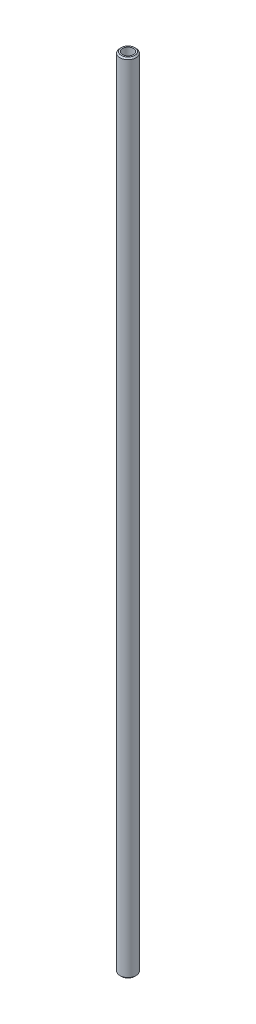
ISO-10303-21;
HEADER;
FILE_DESCRIPTION(('STEP AP214'),'2;1');
FILE_NAME('part.step','',(''),(''),'','','');
FILE_SCHEMA(('AUTOMOTIVE_DESIGN { 1 0 10303 214 1 1 1 1 }'));
ENDSEC;
DATA;
#1=APPLICATION_CONTEXT('core data for automotive mechanical design processes');
#2=APPLICATION_PROTOCOL_DEFINITION('international standard','automotive_design',2000,#1);
#3=PRODUCT_CONTEXT('',#1,'mechanical');
#4=PRODUCT('Part','Part','',(#3));
#5=PRODUCT_RELATED_PRODUCT_CATEGORY('part','',(#4));
#6=PRODUCT_DEFINITION_FORMATION('','',#4);
#7=PRODUCT_DEFINITION_CONTEXT('part definition',#1,'design');
#8=PRODUCT_DEFINITION('design','',#6,#7);
#9=PRODUCT_DEFINITION_SHAPE('','',#8);
#10=(LENGTH_UNIT() NAMED_UNIT(*) SI_UNIT(.MILLI.,.METRE.));
#11=(NAMED_UNIT(*) PLANE_ANGLE_UNIT() SI_UNIT($,.RADIAN.));
#12=(NAMED_UNIT(*) SI_UNIT($,.STERADIAN.) SOLID_ANGLE_UNIT());
#13=UNCERTAINTY_MEASURE_WITH_UNIT(LENGTH_MEASURE(1.E-05),#10,'distance_accuracy_value','');
#14=(GEOMETRIC_REPRESENTATION_CONTEXT(3) GLOBAL_UNCERTAINTY_ASSIGNED_CONTEXT((#13)) GLOBAL_UNIT_ASSIGNED_CONTEXT((#10,
#11,#12)) REPRESENTATION_CONTEXT('',''));
#15=CARTESIAN_POINT('',(0.,0.,0.));
#16=DIRECTION('',(0.,0.,1.));
#17=DIRECTION('',(1.,0.,0.));
#18=AXIS2_PLACEMENT_3D('',#15,#16,#17);
#19=CARTESIAN_POINT('',(3108.80053873964,295.,585.321764207224));
#20=DIRECTION('',(0.,1.,0.));
#21=DIRECTION('',(0.,0.,1.));
#22=AXIS2_PLACEMENT_3D('',#19,#20,#21);
#23=PLANE('',#22);
#24=CARTESIAN_POINT('',(3108.80053873964,295.,585.321764207224));
#25=DIRECTION('',(0.,1.,0.));
#26=DIRECTION('',(0.,0.,1.));
#27=AXIS2_PLACEMENT_3D('',#24,#25,#26);
#28=CIRCLE('',#27,2.50000000000017);
#29=CARTESIAN_POINT('',(3108.80053873964,295.,587.821764207224));
#30=VERTEX_POINT('',#29);
#31=EDGE_CURVE('E49',#30,#30,#28,.T.);
#32=ORIENTED_EDGE('',*,*,#31,.T.);
#33=EDGE_LOOP('',(#32));
#34=FACE_BOUND('',#33,.T.);
#35=CARTESIAN_POINT('',(3108.80053873964,295.,585.321764207224));
#36=DIRECTION('',(0.,1.,0.));
#37=DIRECTION('',(0.,0.,1.));
#38=AXIS2_PLACEMENT_3D('',#35,#36,#37);
#39=CIRCLE('',#38,2.00000000000014);
#40=CARTESIAN_POINT('',(3108.80053873964,295.,587.321764207224));
#41=VERTEX_POINT('',#40);
#42=EDGE_CURVE('E54',#41,#41,#39,.T.);
#43=ORIENTED_EDGE('',*,*,#42,.F.);
#44=EDGE_LOOP('',(#43));
#45=FACE_BOUND('',#44,.T.);
#46=ADVANCED_FACE('F33',(#34,#45),#23,.T.);
#47=CARTESIAN_POINT('',(3108.80053873964,0.,585.321764207224));
#48=DIRECTION('',(0.,1.,0.));
#49=DIRECTION('',(0.,0.,1.));
#50=AXIS2_PLACEMENT_3D('',#47,#48,#49);
#51=PLANE('',#50);
#52=CARTESIAN_POINT('',(3108.80053873964,0.,585.321764207224));
#53=DIRECTION('',(0.,1.,0.));
#54=DIRECTION('',(0.,0.,1.));
#55=AXIS2_PLACEMENT_3D('',#52,#53,#54);
#56=CIRCLE('',#55,2.50000000000017);
#57=CARTESIAN_POINT('',(3108.80053873964,0.,587.821764207224));
#58=VERTEX_POINT('',#57);
#59=EDGE_CURVE('E10',#58,#58,#56,.F.);
#60=ORIENTED_EDGE('',*,*,#59,.T.);
#61=EDGE_LOOP('',(#60));
#62=FACE_BOUND('',#61,.T.);
#63=CARTESIAN_POINT('',(3108.80053873964,0.,585.321764207224));
#64=DIRECTION('',(0.,1.,0.));
#65=DIRECTION('',(0.,0.,1.));
#66=AXIS2_PLACEMENT_3D('',#63,#64,#65);
#67=CIRCLE('',#66,2.00000000000014);
#68=CARTESIAN_POINT('',(3108.80053873964,0.,587.321764207224));
#69=VERTEX_POINT('',#68);
#70=EDGE_CURVE('E55',#69,#69,#67,.T.);
#71=ORIENTED_EDGE('',*,*,#70,.T.);
#72=EDGE_LOOP('',(#71));
#73=FACE_BOUND('',#72,.T.);
#74=ADVANCED_FACE('F65',(#62,#73),#51,.F.);
#75=CARTESIAN_POINT('',(3108.80053873964,295.,585.321764207224));
#76=DIRECTION('',(0.,-1.,0.));
#77=DIRECTION('',(0.,0.,-1.));
#78=AXIS2_PLACEMENT_3D('',#75,#76,#77);
#79=CYLINDRICAL_SURFACE('',#78,3.00000000000015);
#80=CARTESIAN_POINT('',(3108.80053873964,294.5,585.321764207224));
#81=DIRECTION('',(0.,1.,0.));
#82=DIRECTION('',(0.,0.,1.));
#83=AXIS2_PLACEMENT_3D('',#80,#81,#82);
#84=CIRCLE('',#83,3.00000000000015);
#85=CARTESIAN_POINT('',(3108.80053873964,294.5,588.321764207224));
#86=VERTEX_POINT('',#85);
#87=EDGE_CURVE('E41',#86,#86,#84,.F.);
#88=ORIENTED_EDGE('',*,*,#87,.T.);
#89=EDGE_LOOP('',(#88));
#90=FACE_BOUND('',#89,.T.);
#91=CARTESIAN_POINT('',(3108.80053873964,0.500000000000056,585.321764207224));
#92=DIRECTION('',(0.,1.,0.));
#93=DIRECTION('',(0.,0.,1.));
#94=AXIS2_PLACEMENT_3D('',#91,#92,#93);
#95=CIRCLE('',#94,3.00000000000015);
#96=CARTESIAN_POINT('',(3108.80053873964,0.500000000000056,588.321764207224));
#97=VERTEX_POINT('',#96);
#98=EDGE_CURVE('E45',#97,#97,#95,.T.);
#99=ORIENTED_EDGE('',*,*,#98,.T.);
#100=EDGE_LOOP('',(#99));
#101=FACE_BOUND('',#100,.T.);
#102=ADVANCED_FACE('F71',(#90,#101),#79,.T.);
#103=CARTESIAN_POINT('',(3108.80053873964,295.,585.321764207224));
#104=DIRECTION('',(0.,-1.,0.));
#105=DIRECTION('',(0.,0.,-1.));
#106=AXIS2_PLACEMENT_3D('',#103,#104,#105);
#107=CYLINDRICAL_SURFACE('',#106,2.00000000000014);
#108=ORIENTED_EDGE('',*,*,#42,.T.);
#109=EDGE_LOOP('',(#108));
#110=FACE_BOUND('',#109,.T.);
#111=ORIENTED_EDGE('',*,*,#70,.F.);
#112=EDGE_LOOP('',(#111));
#113=FACE_BOUND('',#112,.T.);
#114=ADVANCED_FACE('F61',(#110,#113),#107,.F.);
#115=CARTESIAN_POINT('',(3108.80053873964,295.,585.321764207224));
#116=DIRECTION('',(0.,-1.,0.));
#117=DIRECTION('',(0.,0.,-1.));
#118=AXIS2_PLACEMENT_3D('',#115,#116,#117);
#119=CONICAL_SURFACE('',#118,2.50000000000017,0.785398163397433);
#120=ORIENTED_EDGE('',*,*,#87,.F.);
#121=EDGE_LOOP('',(#120));
#122=FACE_BOUND('',#121,.T.);
#123=ORIENTED_EDGE('',*,*,#31,.F.);
#124=EDGE_LOOP('',(#123));
#125=FACE_BOUND('',#124,.T.);
#126=ADVANCED_FACE('F77',(#122,#125),#119,.T.);
#127=CARTESIAN_POINT('',(3108.80053873964,0.500000000000056,585.321764207224));
#128=DIRECTION('',(0.,1.,0.));
#129=DIRECTION('',(0.,0.,1.));
#130=AXIS2_PLACEMENT_3D('',#127,#128,#129);
#131=CONICAL_SURFACE('',#130,3.00000000000015,0.785398163397378);
#132=ORIENTED_EDGE('',*,*,#59,.F.);
#133=EDGE_LOOP('',(#132));
#134=FACE_BOUND('',#133,.T.);
#135=ORIENTED_EDGE('',*,*,#98,.F.);
#136=EDGE_LOOP('',(#135));
#137=FACE_BOUND('',#136,.T.);
#138=ADVANCED_FACE('F36',(#134,#137),#131,.T.);
#139=CLOSED_SHELL('',(#46,#74,#102,#114,#126,#138));
#140=MANIFOLD_SOLID_BREP('B2',#139);
#141=ADVANCED_BREP_SHAPE_REPRESENTATION('',(#18,#140),#14);
#142=SHAPE_DEFINITION_REPRESENTATION(#9,#141);
ENDSEC;
END-ISO-10303-21;
